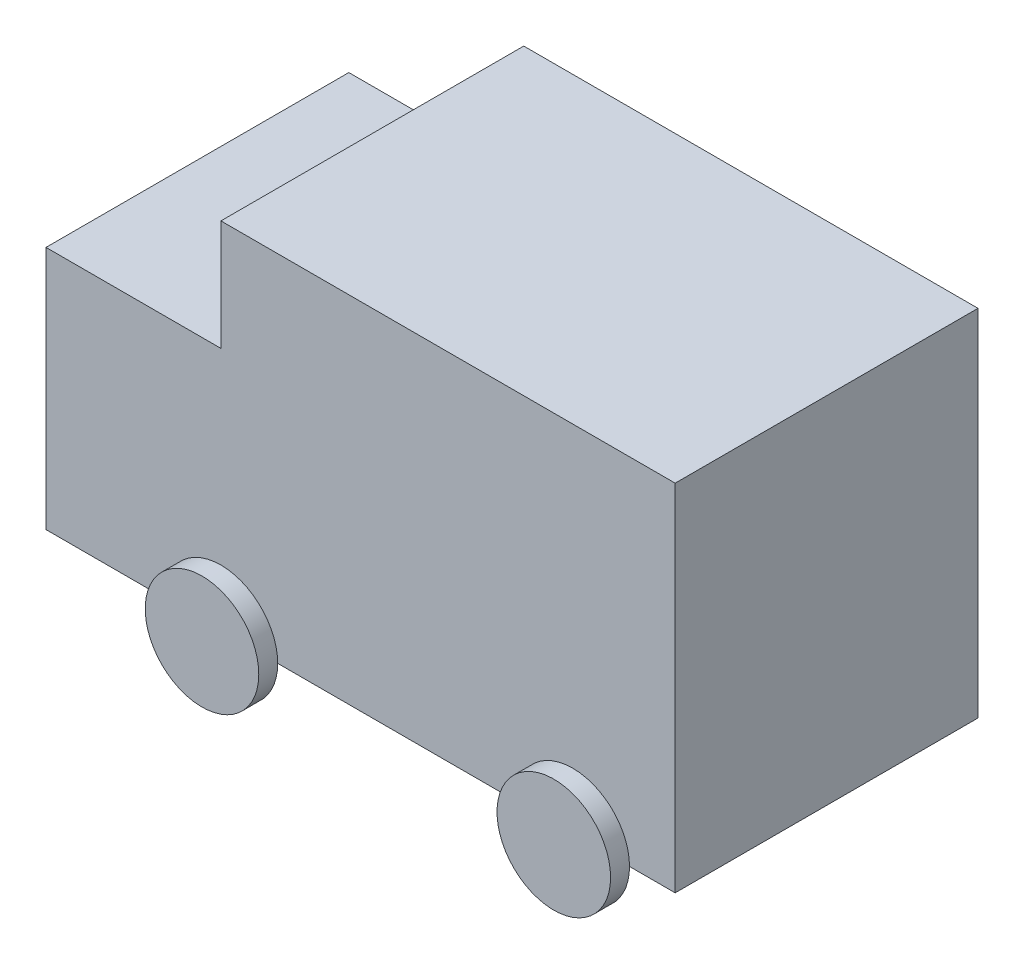
ISO-10303-21;
HEADER;
FILE_DESCRIPTION(('STEP AP214'),'2;1');
FILE_NAME('part.step','',(''),(''),'','','');
FILE_SCHEMA(('AUTOMOTIVE_DESIGN { 1 0 10303 214 1 1 1 1 }'));
ENDSEC;
DATA;
#1=APPLICATION_CONTEXT('core data for automotive mechanical design processes');
#2=APPLICATION_PROTOCOL_DEFINITION('international standard','automotive_design',2000,#1);
#3=PRODUCT_CONTEXT('',#1,'mechanical');
#4=PRODUCT('Part','Part','',(#3));
#5=PRODUCT_RELATED_PRODUCT_CATEGORY('part','',(#4));
#6=PRODUCT_DEFINITION_FORMATION('','',#4);
#7=PRODUCT_DEFINITION_CONTEXT('part definition',#1,'design');
#8=PRODUCT_DEFINITION('design','',#6,#7);
#9=PRODUCT_DEFINITION_SHAPE('','',#8);
#10=(LENGTH_UNIT() NAMED_UNIT(*) SI_UNIT(.MILLI.,.METRE.));
#11=(NAMED_UNIT(*) PLANE_ANGLE_UNIT() SI_UNIT($,.RADIAN.));
#12=(NAMED_UNIT(*) SI_UNIT($,.STERADIAN.) SOLID_ANGLE_UNIT());
#13=UNCERTAINTY_MEASURE_WITH_UNIT(LENGTH_MEASURE(1.E-05),#10,'distance_accuracy_value','');
#14=(GEOMETRIC_REPRESENTATION_CONTEXT(3) GLOBAL_UNCERTAINTY_ASSIGNED_CONTEXT((#13)) GLOBAL_UNIT_ASSIGNED_CONTEXT((#10,
#11,#12)) REPRESENTATION_CONTEXT('',''));
#15=CARTESIAN_POINT('',(0.,0.,0.));
#16=DIRECTION('',(0.,0.,1.));
#17=DIRECTION('',(1.,0.,0.));
#18=AXIS2_PLACEMENT_3D('',#15,#16,#17);
#19=CARTESIAN_POINT('',(0.,2857.,-1219.2));
#20=DIRECTION('',(0.,0.,-1.));
#21=DIRECTION('',(-1.,0.,0.));
#22=AXIS2_PLACEMENT_3D('',#19,#20,#21);
#23=PLANE('',#22);
#24=CARTESIAN_POINT('',(2832.80146302212,0.,-1219.2));
#25=DIRECTION('',(0.,0.,1.));
#26=DIRECTION('',(1.,0.,0.));
#27=AXIS2_PLACEMENT_3D('',#24,#25,#26);
#28=CIRCLE('',#27,457.2);
#29=CARTESIAN_POINT('',(3290.00146302212,0.,-1219.2));
#30=VERTEX_POINT('',#29);
#31=CARTESIAN_POINT('',(2375.60146302212,0.,-1219.2));
#32=VERTEX_POINT('',#31);
#33=EDGE_CURVE('E61',#30,#32,#28,.T.);
#34=ORIENTED_EDGE('',*,*,#33,.T.);
#35=DIRECTION('',(1.,0.,0.));
#36=VECTOR('',#35,1.);
#37=CARTESIAN_POINT('',(0.,0.,-1219.2));
#38=LINE('',#37,#36);
#39=CARTESIAN_POINT('',(457.2,0.,-1219.2));
#40=VERTEX_POINT('',#39);
#41=EDGE_CURVE('E130',#40,#32,#38,.T.);
#42=ORIENTED_EDGE('',*,*,#41,.F.);
#43=CARTESIAN_POINT('',(0.,0.,-1219.2));
#44=DIRECTION('',(0.,0.,1.));
#45=DIRECTION('',(1.,0.,0.));
#46=AXIS2_PLACEMENT_3D('',#43,#44,#45);
#47=CIRCLE('',#46,457.2);
#48=CARTESIAN_POINT('',(-457.2,0.,-1219.2));
#49=VERTEX_POINT('',#48);
#50=EDGE_CURVE('E235',#40,#49,#47,.T.);
#51=ORIENTED_EDGE('',*,*,#50,.T.);
#52=CARTESIAN_POINT('',(-1408.44634060489,0.,-1219.2));
#53=VERTEX_POINT('',#52);
#54=EDGE_CURVE('E148',#53,#49,#38,.T.);
#55=ORIENTED_EDGE('',*,*,#54,.F.);
#56=DIRECTION('',(0.,-1.,0.));
#57=VECTOR('',#56,1.);
#58=CARTESIAN_POINT('',(-1408.44634060489,1968.,-1219.2));
#59=LINE('',#58,#57);
#60=CARTESIAN_POINT('',(-1408.44634060489,1968.,-1219.2));
#61=VERTEX_POINT('',#60);
#62=EDGE_CURVE('E190',#61,#53,#59,.T.);
#63=ORIENTED_EDGE('',*,*,#62,.F.);
#64=DIRECTION('',(-1.,0.,0.));
#65=VECTOR('',#64,1.);
#66=CARTESIAN_POINT('',(0.,1968.,-1219.2));
#67=LINE('',#66,#65);
#68=CARTESIAN_POINT('',(0.,1968.,-1219.2));
#69=VERTEX_POINT('',#68);
#70=EDGE_CURVE('E211',#69,#61,#67,.T.);
#71=ORIENTED_EDGE('',*,*,#70,.F.);
#72=DIRECTION('',(0.,-1.,0.));
#73=VECTOR('',#72,1.);
#74=CARTESIAN_POINT('',(0.,2857.,-1219.2));
#75=LINE('',#74,#73);
#76=CARTESIAN_POINT('',(0.,2857.,-1219.2));
#77=VERTEX_POINT('',#76);
#78=EDGE_CURVE('E11',#77,#69,#75,.T.);
#79=ORIENTED_EDGE('',*,*,#78,.F.);
#80=DIRECTION('',(1.,0.,0.));
#81=VECTOR('',#80,1.);
#82=CARTESIAN_POINT('',(0.,2857.,-1219.2));
#83=LINE('',#82,#81);
#84=CARTESIAN_POINT('',(3657.6,2857.,-1219.2));
#85=VERTEX_POINT('',#84);
#86=EDGE_CURVE('E161',#77,#85,#83,.T.);
#87=ORIENTED_EDGE('',*,*,#86,.T.);
#88=DIRECTION('',(0.,-1.,0.));
#89=VECTOR('',#88,1.);
#90=CARTESIAN_POINT('',(3657.6,2857.,-1219.2));
#91=LINE('',#90,#89);
#92=CARTESIAN_POINT('',(3657.6,0.,-1219.2));
#93=VERTEX_POINT('',#92);
#94=EDGE_CURVE('E48',#85,#93,#91,.T.);
#95=ORIENTED_EDGE('',*,*,#94,.T.);
#96=EDGE_CURVE('E131',#30,#93,#38,.T.);
#97=ORIENTED_EDGE('',*,*,#96,.F.);
#98=EDGE_LOOP('',(#34,#42,#51,#55,#63,#71,#79,#87,#95,#97));
#99=FACE_BOUND('',#98,.T.);
#100=ADVANCED_FACE('F45',(#99),#23,.T.);
#101=CARTESIAN_POINT('',(0.,2857.,1219.2));
#102=DIRECTION('',(-1.,0.,0.));
#103=DIRECTION('',(0.,0.,1.));
#104=AXIS2_PLACEMENT_3D('',#101,#102,#103);
#105=PLANE('',#104);
#106=DIRECTION('',(0.,0.,-1.));
#107=VECTOR('',#106,1.);
#108=CARTESIAN_POINT('',(0.,1968.,-1219.2));
#109=LINE('',#108,#107);
#110=CARTESIAN_POINT('',(0.,1968.,1219.2));
#111=VERTEX_POINT('',#110);
#112=EDGE_CURVE('E203',#111,#69,#109,.T.);
#113=ORIENTED_EDGE('',*,*,#112,.F.);
#114=DIRECTION('',(0.,-1.,0.));
#115=VECTOR('',#114,1.);
#116=CARTESIAN_POINT('',(0.,2857.,1219.2));
#117=LINE('',#116,#115);
#118=CARTESIAN_POINT('',(0.,2857.,1219.2));
#119=VERTEX_POINT('',#118);
#120=EDGE_CURVE('E54',#119,#111,#117,.T.);
#121=ORIENTED_EDGE('',*,*,#120,.F.);
#122=DIRECTION('',(0.,0.,-1.));
#123=VECTOR('',#122,1.);
#124=CARTESIAN_POINT('',(0.,2857.,1219.2));
#125=LINE('',#124,#123);
#126=EDGE_CURVE('E153',#119,#77,#125,.T.);
#127=ORIENTED_EDGE('',*,*,#126,.T.);
#128=ORIENTED_EDGE('',*,*,#78,.T.);
#129=EDGE_LOOP('',(#113,#121,#127,#128));
#130=FACE_BOUND('',#129,.T.);
#131=ADVANCED_FACE('F305',(#130),#105,.T.);
#132=CARTESIAN_POINT('',(0.,2857.,1219.2));
#133=DIRECTION('',(0.,0.,-1.));
#134=DIRECTION('',(-1.,0.,0.));
#135=AXIS2_PLACEMENT_3D('',#132,#133,#134);
#136=PLANE('',#135);
#137=CARTESIAN_POINT('',(2832.80146302212,0.,1219.2));
#138=DIRECTION('',(0.,0.,1.));
#139=DIRECTION('',(1.,0.,0.));
#140=AXIS2_PLACEMENT_3D('',#137,#138,#139);
#141=CIRCLE('',#140,457.2);
#142=CARTESIAN_POINT('',(3290.00146302212,0.,1219.2));
#143=VERTEX_POINT('',#142);
#144=CARTESIAN_POINT('',(2375.60146302212,0.,1219.2));
#145=VERTEX_POINT('',#144);
#146=EDGE_CURVE('E231',#143,#145,#141,.T.);
#147=ORIENTED_EDGE('',*,*,#146,.F.);
#148=DIRECTION('',(1.,0.,0.));
#149=VECTOR('',#148,1.);
#150=CARTESIAN_POINT('',(0.,0.,1219.2));
#151=LINE('',#150,#149);
#152=CARTESIAN_POINT('',(3657.6,0.,1219.2));
#153=VERTEX_POINT('',#152);
#154=EDGE_CURVE('E158',#143,#153,#151,.T.);
#155=ORIENTED_EDGE('',*,*,#154,.T.);
#156=DIRECTION('',(0.,-1.,0.));
#157=VECTOR('',#156,1.);
#158=CARTESIAN_POINT('',(3657.6,2857.,1219.2));
#159=LINE('',#158,#157);
#160=CARTESIAN_POINT('',(3657.6,2857.,1219.2));
#161=VERTEX_POINT('',#160);
#162=EDGE_CURVE('E166',#161,#153,#159,.T.);
#163=ORIENTED_EDGE('',*,*,#162,.F.);
#164=DIRECTION('',(1.,0.,0.));
#165=VECTOR('',#164,1.);
#166=CARTESIAN_POINT('',(0.,2857.,1219.2));
#167=LINE('',#166,#165);
#168=EDGE_CURVE('E178',#119,#161,#167,.T.);
#169=ORIENTED_EDGE('',*,*,#168,.F.);
#170=ORIENTED_EDGE('',*,*,#120,.T.);
#171=DIRECTION('',(1.,0.,0.));
#172=VECTOR('',#171,1.);
#173=CARTESIAN_POINT('',(2.98617875504091E-13,1968.,1219.2));
#174=LINE('',#173,#172);
#175=CARTESIAN_POINT('',(-1408.44634060489,1968.,1219.2));
#176=VERTEX_POINT('',#175);
#177=EDGE_CURVE('E198',#176,#111,#174,.T.);
#178=ORIENTED_EDGE('',*,*,#177,.F.);
#179=DIRECTION('',(0.,-1.,0.));
#180=VECTOR('',#179,1.);
#181=CARTESIAN_POINT('',(-1408.44634060489,1968.,1219.2));
#182=LINE('',#181,#180);
#183=CARTESIAN_POINT('',(-1408.44634060489,0.,1219.2));
#184=VERTEX_POINT('',#183);
#185=EDGE_CURVE('E194',#176,#184,#182,.T.);
#186=ORIENTED_EDGE('',*,*,#185,.T.);
#187=CARTESIAN_POINT('',(-457.2,0.,1219.2));
#188=VERTEX_POINT('',#187);
#189=EDGE_CURVE('E159',#184,#188,#151,.T.);
#190=ORIENTED_EDGE('',*,*,#189,.T.);
#191=CARTESIAN_POINT('',(0.,0.,1219.2));
#192=DIRECTION('',(0.,0.,1.));
#193=DIRECTION('',(1.,0.,0.));
#194=AXIS2_PLACEMENT_3D('',#191,#192,#193);
#195=CIRCLE('',#194,457.2);
#196=CARTESIAN_POINT('',(457.2,0.,1219.2));
#197=VERTEX_POINT('',#196);
#198=EDGE_CURVE('E217',#197,#188,#195,.T.);
#199=ORIENTED_EDGE('',*,*,#198,.F.);
#200=EDGE_CURVE('E281',#197,#145,#151,.T.);
#201=ORIENTED_EDGE('',*,*,#200,.T.);
#202=EDGE_LOOP('',(#147,#155,#163,#169,#170,#178,#186,#190,#199,#201));
#203=FACE_BOUND('',#202,.T.);
#204=ADVANCED_FACE('F259',(#203),#136,.F.);
#205=CARTESIAN_POINT('',(3657.6,2857.,1219.2));
#206=DIRECTION('',(-1.,0.,0.));
#207=DIRECTION('',(0.,0.,1.));
#208=AXIS2_PLACEMENT_3D('',#205,#206,#207);
#209=PLANE('',#208);
#210=DIRECTION('',(0.,0.,-1.));
#211=VECTOR('',#210,1.);
#212=CARTESIAN_POINT('',(3657.6,0.,1219.2));
#213=LINE('',#212,#211);
#214=EDGE_CURVE('E152',#153,#93,#213,.T.);
#215=ORIENTED_EDGE('',*,*,#214,.T.);
#216=ORIENTED_EDGE('',*,*,#94,.F.);
#217=DIRECTION('',(0.,0.,-1.));
#218=VECTOR('',#217,1.);
#219=CARTESIAN_POINT('',(3657.6,2857.,1219.2));
#220=LINE('',#219,#218);
#221=EDGE_CURVE('E182',#161,#85,#220,.T.);
#222=ORIENTED_EDGE('',*,*,#221,.F.);
#223=ORIENTED_EDGE('',*,*,#162,.T.);
#224=EDGE_LOOP('',(#215,#216,#222,#223));
#225=FACE_BOUND('',#224,.T.);
#226=ADVANCED_FACE('F265',(#225),#209,.F.);
#227=CARTESIAN_POINT('',(0.,2857.,0.));
#228=DIRECTION('',(0.,1.,0.));
#229=DIRECTION('',(0.,0.,1.));
#230=AXIS2_PLACEMENT_3D('',#227,#228,#229);
#231=PLANE('',#230);
#232=ORIENTED_EDGE('',*,*,#86,.F.);
#233=ORIENTED_EDGE('',*,*,#126,.F.);
#234=ORIENTED_EDGE('',*,*,#168,.T.);
#235=ORIENTED_EDGE('',*,*,#221,.T.);
#236=EDGE_LOOP('',(#232,#233,#234,#235));
#237=FACE_BOUND('',#236,.T.);
#238=ADVANCED_FACE('F264',(#237),#231,.T.);
#239=CARTESIAN_POINT('',(0.,0.,0.));
#240=DIRECTION('',(0.,1.,0.));
#241=DIRECTION('',(0.,0.,1.));
#242=AXIS2_PLACEMENT_3D('',#239,#240,#241);
#243=PLANE('',#242);
#244=ORIENTED_EDGE('',*,*,#54,.T.);
#245=EDGE_CURVE('E145',#49,#40,#38,.T.);
#246=ORIENTED_EDGE('',*,*,#245,.T.);
#247=ORIENTED_EDGE('',*,*,#41,.T.);
#248=EDGE_CURVE('E123',#32,#30,#38,.T.);
#249=ORIENTED_EDGE('',*,*,#248,.T.);
#250=ORIENTED_EDGE('',*,*,#96,.T.);
#251=ORIENTED_EDGE('',*,*,#214,.F.);
#252=ORIENTED_EDGE('',*,*,#154,.F.);
#253=EDGE_CURVE('E277',#145,#143,#151,.T.);
#254=ORIENTED_EDGE('',*,*,#253,.F.);
#255=ORIENTED_EDGE('',*,*,#200,.F.);
#256=EDGE_CURVE('E162',#188,#197,#151,.T.);
#257=ORIENTED_EDGE('',*,*,#256,.F.);
#258=ORIENTED_EDGE('',*,*,#189,.F.);
#259=DIRECTION('',(0.,0.,1.));
#260=VECTOR('',#259,1.);
#261=CARTESIAN_POINT('',(-1408.44634060489,0.,-1219.2));
#262=LINE('',#261,#260);
#263=EDGE_CURVE('E199',#53,#184,#262,.T.);
#264=ORIENTED_EDGE('',*,*,#263,.F.);
#265=EDGE_LOOP('',(#244,#246,#247,#249,#250,#251,#252,#254,#255,#257,#258,#264));
#266=FACE_BOUND('',#265,.T.);
#267=ADVANCED_FACE('F144',(#266),#243,.F.);
#268=CARTESIAN_POINT('',(-1408.44634060489,1968.,-1219.2));
#269=DIRECTION('',(1.,0.,0.));
#270=DIRECTION('',(0.,0.,-1.));
#271=AXIS2_PLACEMENT_3D('',#268,#269,#270);
#272=PLANE('',#271);
#273=ORIENTED_EDGE('',*,*,#263,.T.);
#274=ORIENTED_EDGE('',*,*,#185,.F.);
#275=DIRECTION('',(0.,0.,1.));
#276=VECTOR('',#275,1.);
#277=CARTESIAN_POINT('',(-1408.44634060489,1968.,-1219.2));
#278=LINE('',#277,#276);
#279=EDGE_CURVE('E208',#61,#176,#278,.T.);
#280=ORIENTED_EDGE('',*,*,#279,.F.);
#281=ORIENTED_EDGE('',*,*,#62,.T.);
#282=EDGE_LOOP('',(#273,#274,#280,#281));
#283=FACE_BOUND('',#282,.T.);
#284=ADVANCED_FACE('F254',(#283),#272,.F.);
#285=CARTESIAN_POINT('',(0.,1968.,0.));
#286=DIRECTION('',(0.,-1.,0.));
#287=DIRECTION('',(0.,0.,-1.));
#288=AXIS2_PLACEMENT_3D('',#285,#286,#287);
#289=PLANE('',#288);
#290=ORIENTED_EDGE('',*,*,#112,.T.);
#291=ORIENTED_EDGE('',*,*,#70,.T.);
#292=ORIENTED_EDGE('',*,*,#279,.T.);
#293=ORIENTED_EDGE('',*,*,#177,.T.);
#294=EDGE_LOOP('',(#290,#291,#292,#293));
#295=FACE_BOUND('',#294,.T.);
#296=ADVANCED_FACE('F261',(#295),#289,.F.);
#297=CARTESIAN_POINT('',(0.,0.,1219.2));
#298=DIRECTION('',(0.,0.,1.));
#299=DIRECTION('',(1.,0.,0.));
#300=AXIS2_PLACEMENT_3D('',#297,#298,#299);
#301=PLANE('',#300);
#302=EDGE_CURVE('E221',#188,#197,#195,.T.);
#303=ORIENTED_EDGE('',*,*,#302,.F.);
#304=ORIENTED_EDGE('',*,*,#256,.T.);
#305=EDGE_LOOP('',(#303,#304));
#306=FACE_BOUND('',#305,.T.);
#307=ADVANCED_FACE('F287',(#306),#301,.F.);
#308=CARTESIAN_POINT('',(0.,0.,1371.6));
#309=DIRECTION('',(0.,0.,-1.));
#310=DIRECTION('',(-1.,0.,0.));
#311=AXIS2_PLACEMENT_3D('',#308,#309,#310);
#312=CYLINDRICAL_SURFACE('',#311,457.2);
#313=CARTESIAN_POINT('',(0.,0.,1371.6));
#314=DIRECTION('',(0.,0.,1.));
#315=DIRECTION('',(1.,0.,0.));
#316=AXIS2_PLACEMENT_3D('',#313,#314,#315);
#317=CIRCLE('',#316,457.2);
#318=CARTESIAN_POINT('',(457.2,0.,1371.6));
#319=VERTEX_POINT('',#318);
#320=EDGE_CURVE('E204',#319,#319,#317,.T.);
#321=ORIENTED_EDGE('',*,*,#320,.F.);
#322=EDGE_LOOP('',(#321));
#323=FACE_BOUND('',#322,.T.);
#324=ORIENTED_EDGE('',*,*,#198,.T.);
#325=ORIENTED_EDGE('',*,*,#302,.T.);
#326=EDGE_LOOP('',(#324,#325));
#327=FACE_BOUND('',#326,.T.);
#328=ADVANCED_FACE('F290',(#323,#327),#312,.T.);
#329=CARTESIAN_POINT('',(0.,0.,1371.6));
#330=DIRECTION('',(0.,0.,1.));
#331=DIRECTION('',(1.,0.,0.));
#332=AXIS2_PLACEMENT_3D('',#329,#330,#331);
#333=PLANE('',#332);
#334=ORIENTED_EDGE('',*,*,#320,.T.);
#335=EDGE_LOOP('',(#334));
#336=FACE_BOUND('',#335,.T.);
#337=ADVANCED_FACE('F292',(#336),#333,.T.);
#338=CARTESIAN_POINT('',(2832.80146302212,0.,1219.2));
#339=DIRECTION('',(0.,0.,1.));
#340=DIRECTION('',(1.,0.,0.));
#341=AXIS2_PLACEMENT_3D('',#338,#339,#340);
#342=PLANE('',#341);
#343=EDGE_CURVE('E229',#145,#143,#141,.T.);
#344=ORIENTED_EDGE('',*,*,#343,.F.);
#345=ORIENTED_EDGE('',*,*,#253,.T.);
#346=EDGE_LOOP('',(#344,#345));
#347=FACE_BOUND('',#346,.T.);
#348=ADVANCED_FACE('F276',(#347),#342,.F.);
#349=CARTESIAN_POINT('',(2832.80146302212,0.,1371.6));
#350=DIRECTION('',(0.,0.,-1.));
#351=DIRECTION('',(-1.,0.,0.));
#352=AXIS2_PLACEMENT_3D('',#349,#350,#351);
#353=CYLINDRICAL_SURFACE('',#352,457.2);
#354=CARTESIAN_POINT('',(2832.80146302212,0.,1371.6));
#355=DIRECTION('',(0.,0.,1.));
#356=DIRECTION('',(1.,0.,0.));
#357=AXIS2_PLACEMENT_3D('',#354,#355,#356);
#358=CIRCLE('',#357,457.2);
#359=CARTESIAN_POINT('',(3290.00146302212,0.,1371.6));
#360=VERTEX_POINT('',#359);
#361=EDGE_CURVE('E225',#360,#360,#358,.T.);
#362=ORIENTED_EDGE('',*,*,#361,.F.);
#363=EDGE_LOOP('',(#362));
#364=FACE_BOUND('',#363,.T.);
#365=ORIENTED_EDGE('',*,*,#146,.T.);
#366=ORIENTED_EDGE('',*,*,#343,.T.);
#367=EDGE_LOOP('',(#365,#366));
#368=FACE_BOUND('',#367,.T.);
#369=ADVANCED_FACE('F273',(#364,#368),#353,.T.);
#370=CARTESIAN_POINT('',(2832.80146302212,0.,1371.6));
#371=DIRECTION('',(0.,0.,1.));
#372=DIRECTION('',(1.,0.,0.));
#373=AXIS2_PLACEMENT_3D('',#370,#371,#372);
#374=PLANE('',#373);
#375=ORIENTED_EDGE('',*,*,#361,.T.);
#376=EDGE_LOOP('',(#375));
#377=FACE_BOUND('',#376,.T.);
#378=ADVANCED_FACE('F369',(#377),#374,.T.);
#379=CARTESIAN_POINT('',(0.,0.,-1371.6));
#380=DIRECTION('',(0.,0.,1.));
#381=DIRECTION('',(1.,0.,0.));
#382=AXIS2_PLACEMENT_3D('',#379,#380,#381);
#383=CYLINDRICAL_SURFACE('',#382,457.2);
#384=CARTESIAN_POINT('',(0.,0.,-1371.6));
#385=DIRECTION('',(0.,0.,1.));
#386=DIRECTION('',(1.,0.,0.));
#387=AXIS2_PLACEMENT_3D('',#384,#385,#386);
#388=CIRCLE('',#387,457.2);
#389=CARTESIAN_POINT('',(457.2,0.,-1371.6));
#390=VERTEX_POINT('',#389);
#391=EDGE_CURVE('E230',#390,#390,#388,.T.);
#392=ORIENTED_EDGE('',*,*,#391,.T.);
#393=EDGE_LOOP('',(#392));
#394=FACE_BOUND('',#393,.T.);
#395=ORIENTED_EDGE('',*,*,#50,.F.);
#396=EDGE_CURVE('E68',#49,#40,#47,.T.);
#397=ORIENTED_EDGE('',*,*,#396,.F.);
#398=EDGE_LOOP('',(#395,#397));
#399=FACE_BOUND('',#398,.T.);
#400=ADVANCED_FACE('F248',(#394,#399),#383,.T.);
#401=CARTESIAN_POINT('',(0.,0.,-1371.6));
#402=DIRECTION('',(0.,0.,-1.));
#403=DIRECTION('',(1.,0.,0.));
#404=AXIS2_PLACEMENT_3D('',#401,#402,#403);
#405=PLANE('',#404);
#406=ORIENTED_EDGE('',*,*,#391,.F.);
#407=EDGE_LOOP('',(#406));
#408=FACE_BOUND('',#407,.T.);
#409=ADVANCED_FACE('F403',(#408),#405,.T.);
#410=CARTESIAN_POINT('',(0.,0.,-1219.2));
#411=DIRECTION('',(0.,0.,-1.));
#412=DIRECTION('',(1.,0.,0.));
#413=AXIS2_PLACEMENT_3D('',#410,#411,#412);
#414=PLANE('',#413);
#415=ORIENTED_EDGE('',*,*,#245,.F.);
#416=ORIENTED_EDGE('',*,*,#396,.T.);
#417=EDGE_LOOP('',(#415,#416));
#418=FACE_BOUND('',#417,.T.);
#419=ADVANCED_FACE('F247',(#418),#414,.F.);
#420=CARTESIAN_POINT('',(2832.80146302212,0.,-1219.2));
#421=DIRECTION('',(0.,0.,-1.));
#422=DIRECTION('',(1.,0.,0.));
#423=AXIS2_PLACEMENT_3D('',#420,#421,#422);
#424=PLANE('',#423);
#425=EDGE_CURVE('E125',#32,#30,#28,.T.);
#426=ORIENTED_EDGE('',*,*,#425,.T.);
#427=ORIENTED_EDGE('',*,*,#248,.F.);
#428=EDGE_LOOP('',(#426,#427));
#429=FACE_BOUND('',#428,.T.);
#430=ADVANCED_FACE('F124',(#429),#424,.F.);
#431=CARTESIAN_POINT('',(2832.80146302212,0.,-1371.6));
#432=DIRECTION('',(0.,0.,1.));
#433=DIRECTION('',(1.,0.,0.));
#434=AXIS2_PLACEMENT_3D('',#431,#432,#433);
#435=CYLINDRICAL_SURFACE('',#434,457.2);
#436=CARTESIAN_POINT('',(2832.80146302212,0.,-1371.6));
#437=DIRECTION('',(0.,0.,1.));
#438=DIRECTION('',(1.,0.,0.));
#439=AXIS2_PLACEMENT_3D('',#436,#437,#438);
#440=CIRCLE('',#439,457.2);
#441=CARTESIAN_POINT('',(3290.00146302212,0.,-1371.6));
#442=VERTEX_POINT('',#441);
#443=EDGE_CURVE('E142',#442,#442,#440,.T.);
#444=ORIENTED_EDGE('',*,*,#443,.T.);
#445=EDGE_LOOP('',(#444));
#446=FACE_BOUND('',#445,.T.);
#447=ORIENTED_EDGE('',*,*,#33,.F.);
#448=ORIENTED_EDGE('',*,*,#425,.F.);
#449=EDGE_LOOP('',(#447,#448));
#450=FACE_BOUND('',#449,.T.);
#451=ADVANCED_FACE('F133',(#446,#450),#435,.T.);
#452=CARTESIAN_POINT('',(2832.80146302212,0.,-1371.6));
#453=DIRECTION('',(0.,0.,-1.));
#454=DIRECTION('',(1.,0.,0.));
#455=AXIS2_PLACEMENT_3D('',#452,#453,#454);
#456=PLANE('',#455);
#457=ORIENTED_EDGE('',*,*,#443,.F.);
#458=EDGE_LOOP('',(#457));
#459=FACE_BOUND('',#458,.T.);
#460=ADVANCED_FACE('F442',(#459),#456,.T.);
#461=CLOSED_SHELL('',(#100,#131,#204,#226,#238,#267,#284,#296,#307,#328,#337,#348,#369,#378,
#400,#409,#419,#430,#451,#460));
#462=MANIFOLD_SOLID_BREP('B2',#461);
#463=ADVANCED_BREP_SHAPE_REPRESENTATION('',(#18,#462),#14);
#464=SHAPE_DEFINITION_REPRESENTATION(#9,#463);
ENDSEC;
END-ISO-10303-21;
